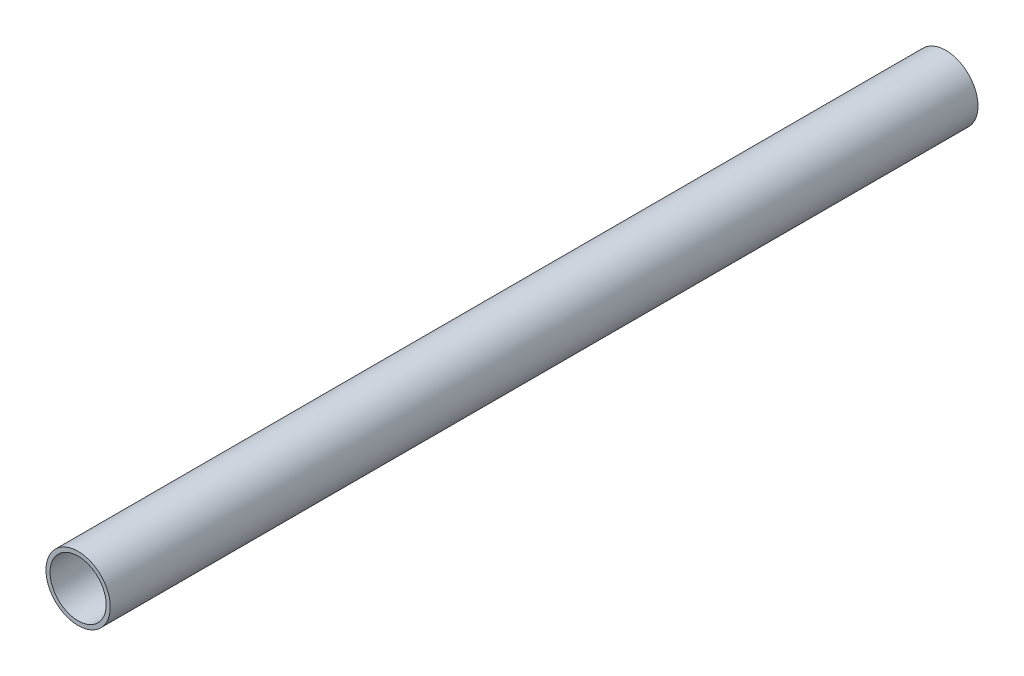
ISO-10303-21;
HEADER;
FILE_DESCRIPTION(('STEP AP214'),'2;1');
FILE_NAME('part.step','',(''),(''),'','','');
FILE_SCHEMA(('AUTOMOTIVE_DESIGN { 1 0 10303 214 1 1 1 1 }'));
ENDSEC;
DATA;
#1=APPLICATION_CONTEXT('core data for automotive mechanical design processes');
#2=APPLICATION_PROTOCOL_DEFINITION('international standard','automotive_design',2000,#1);
#3=PRODUCT_CONTEXT('',#1,'mechanical');
#4=PRODUCT('Part','Part','',(#3));
#5=PRODUCT_RELATED_PRODUCT_CATEGORY('part','',(#4));
#6=PRODUCT_DEFINITION_FORMATION('','',#4);
#7=PRODUCT_DEFINITION_CONTEXT('part definition',#1,'design');
#8=PRODUCT_DEFINITION('design','',#6,#7);
#9=PRODUCT_DEFINITION_SHAPE('','',#8);
#10=(LENGTH_UNIT() NAMED_UNIT(*) SI_UNIT(.MILLI.,.METRE.));
#11=(NAMED_UNIT(*) PLANE_ANGLE_UNIT() SI_UNIT($,.RADIAN.));
#12=(NAMED_UNIT(*) SI_UNIT($,.STERADIAN.) SOLID_ANGLE_UNIT());
#13=UNCERTAINTY_MEASURE_WITH_UNIT(LENGTH_MEASURE(1.E-05),#10,'distance_accuracy_value','');
#14=(GEOMETRIC_REPRESENTATION_CONTEXT(3) GLOBAL_UNCERTAINTY_ASSIGNED_CONTEXT((#13)) GLOBAL_UNIT_ASSIGNED_CONTEXT((#10,
#11,#12)) REPRESENTATION_CONTEXT('',''));
#15=CARTESIAN_POINT('',(0.,0.,0.));
#16=DIRECTION('',(0.,0.,1.));
#17=DIRECTION('',(1.,0.,0.));
#18=AXIS2_PLACEMENT_3D('',#15,#16,#17);
#19=CARTESIAN_POINT('',(0.,0.,510.54));
#20=DIRECTION('',(0.,0.,1.));
#21=DIRECTION('',(1.,0.,0.));
#22=AXIS2_PLACEMENT_3D('',#19,#20,#21);
#23=PLANE('',#22);
#24=CARTESIAN_POINT('',(0.,0.,510.54));
#25=DIRECTION('',(0.,0.,1.));
#26=DIRECTION('',(1.,0.,0.));
#27=AXIS2_PLACEMENT_3D('',#24,#25,#26);
#28=CIRCLE('',#27,18.923);
#29=CARTESIAN_POINT('',(18.923,0.,510.54));
#30=VERTEX_POINT('',#29);
#31=EDGE_CURVE('E10',#30,#30,#28,.T.);
#32=ORIENTED_EDGE('',*,*,#31,.T.);
#33=EDGE_LOOP('',(#32));
#34=FACE_BOUND('',#33,.T.);
#35=CARTESIAN_POINT('',(0.,0.,510.54));
#36=DIRECTION('',(0.,0.,1.));
#37=DIRECTION('',(1.,0.,0.));
#38=AXIS2_PLACEMENT_3D('',#35,#36,#37);
#39=CIRCLE('',#38,16.51);
#40=CARTESIAN_POINT('',(16.51,0.,510.54));
#41=VERTEX_POINT('',#40);
#42=EDGE_CURVE('E42',#41,#41,#39,.T.);
#43=ORIENTED_EDGE('',*,*,#42,.F.);
#44=EDGE_LOOP('',(#43));
#45=FACE_BOUND('',#44,.T.);
#46=ADVANCED_FACE('F31',(#34,#45),#23,.T.);
#47=CARTESIAN_POINT('',(0.,0.,0.));
#48=DIRECTION('',(0.,0.,1.));
#49=DIRECTION('',(1.,0.,0.));
#50=AXIS2_PLACEMENT_3D('',#47,#48,#49);
#51=PLANE('',#50);
#52=CARTESIAN_POINT('',(0.,0.,0.));
#53=DIRECTION('',(0.,0.,1.));
#54=DIRECTION('',(1.,0.,0.));
#55=AXIS2_PLACEMENT_3D('',#52,#53,#54);
#56=CIRCLE('',#55,18.923);
#57=CARTESIAN_POINT('',(18.923,0.,0.));
#58=VERTEX_POINT('',#57);
#59=EDGE_CURVE('E35',#58,#58,#56,.T.);
#60=ORIENTED_EDGE('',*,*,#59,.F.);
#61=EDGE_LOOP('',(#60));
#62=FACE_BOUND('',#61,.T.);
#63=CARTESIAN_POINT('',(0.,0.,0.));
#64=DIRECTION('',(0.,0.,1.));
#65=DIRECTION('',(1.,0.,0.));
#66=AXIS2_PLACEMENT_3D('',#63,#64,#65);
#67=CIRCLE('',#66,16.51);
#68=CARTESIAN_POINT('',(16.51,0.,0.));
#69=VERTEX_POINT('',#68);
#70=EDGE_CURVE('E44',#69,#69,#67,.T.);
#71=ORIENTED_EDGE('',*,*,#70,.T.);
#72=EDGE_LOOP('',(#71));
#73=FACE_BOUND('',#72,.T.);
#74=ADVANCED_FACE('F54',(#62,#73),#51,.F.);
#75=CARTESIAN_POINT('',(0.,0.,510.54));
#76=DIRECTION('',(0.,0.,-1.));
#77=DIRECTION('',(-1.,0.,0.));
#78=AXIS2_PLACEMENT_3D('',#75,#76,#77);
#79=CYLINDRICAL_SURFACE('',#78,18.923);
#80=ORIENTED_EDGE('',*,*,#31,.F.);
#81=EDGE_LOOP('',(#80));
#82=FACE_BOUND('',#81,.T.);
#83=ORIENTED_EDGE('',*,*,#59,.T.);
#84=EDGE_LOOP('',(#83));
#85=FACE_BOUND('',#84,.T.);
#86=ADVANCED_FACE('F33',(#82,#85),#79,.T.);
#87=CARTESIAN_POINT('',(0.,0.,510.54));
#88=DIRECTION('',(0.,0.,-1.));
#89=DIRECTION('',(-1.,0.,0.));
#90=AXIS2_PLACEMENT_3D('',#87,#88,#89);
#91=CYLINDRICAL_SURFACE('',#90,16.51);
#92=ORIENTED_EDGE('',*,*,#42,.T.);
#93=EDGE_LOOP('',(#92));
#94=FACE_BOUND('',#93,.T.);
#95=ORIENTED_EDGE('',*,*,#70,.F.);
#96=EDGE_LOOP('',(#95));
#97=FACE_BOUND('',#96,.T.);
#98=ADVANCED_FACE('F50',(#94,#97),#91,.F.);
#99=CLOSED_SHELL('',(#46,#74,#86,#98));
#100=MANIFOLD_SOLID_BREP('B2',#99);
#101=ADVANCED_BREP_SHAPE_REPRESENTATION('',(#18,#100),#14);
#102=SHAPE_DEFINITION_REPRESENTATION(#9,#101);
ENDSEC;
END-ISO-10303-21;
